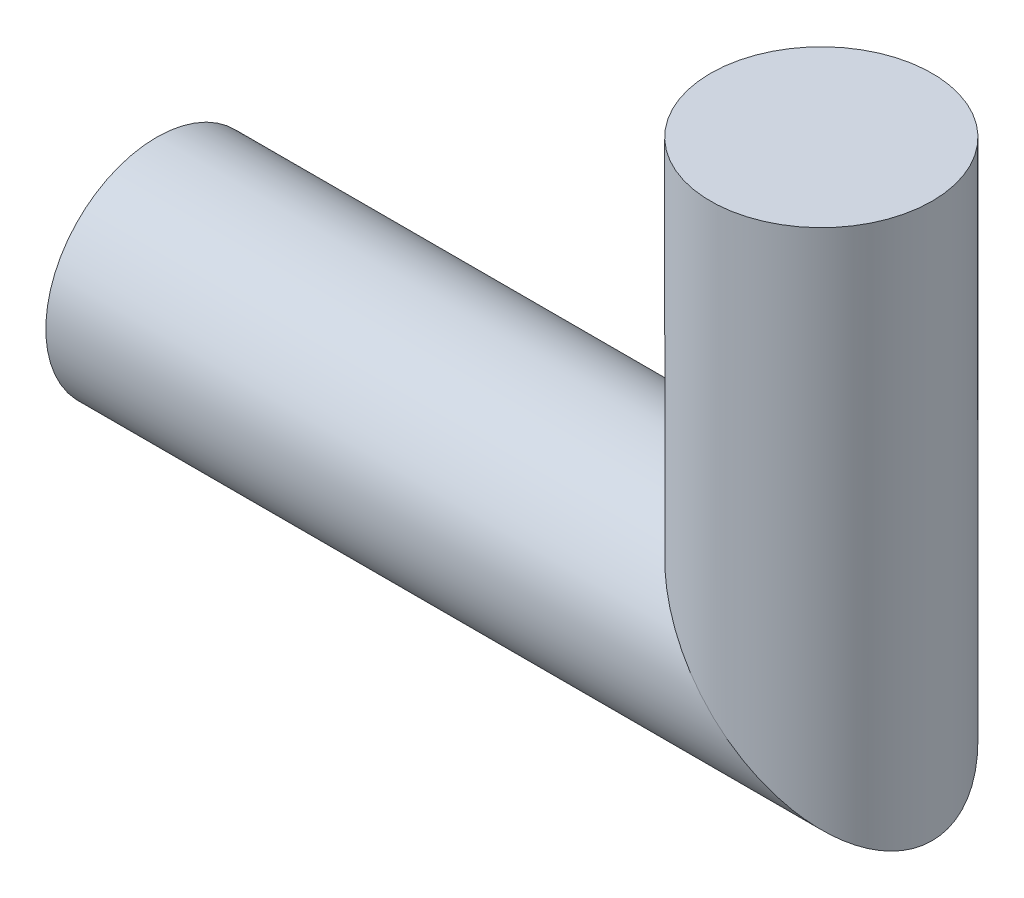
ISO-10303-21;
HEADER;
FILE_DESCRIPTION(('STEP AP214'),'2;1');
FILE_NAME('part.step','',(''),(''),'','','');
FILE_SCHEMA(('AUTOMOTIVE_DESIGN { 1 0 10303 214 1 1 1 1 }'));
ENDSEC;
DATA;
#1=APPLICATION_CONTEXT('core data for automotive mechanical design processes');
#2=APPLICATION_PROTOCOL_DEFINITION('international standard','automotive_design',2000,#1);
#3=PRODUCT_CONTEXT('',#1,'mechanical');
#4=PRODUCT('Part','Part','',(#3));
#5=PRODUCT_RELATED_PRODUCT_CATEGORY('part','',(#4));
#6=PRODUCT_DEFINITION_FORMATION('','',#4);
#7=PRODUCT_DEFINITION_CONTEXT('part definition',#1,'design');
#8=PRODUCT_DEFINITION('design','',#6,#7);
#9=PRODUCT_DEFINITION_SHAPE('','',#8);
#10=(LENGTH_UNIT() NAMED_UNIT(*) SI_UNIT(.MILLI.,.METRE.));
#11=(NAMED_UNIT(*) PLANE_ANGLE_UNIT() SI_UNIT($,.RADIAN.));
#12=(NAMED_UNIT(*) SI_UNIT($,.STERADIAN.) SOLID_ANGLE_UNIT());
#13=UNCERTAINTY_MEASURE_WITH_UNIT(LENGTH_MEASURE(1.E-05),#10,'distance_accuracy_value','');
#14=(GEOMETRIC_REPRESENTATION_CONTEXT(3) GLOBAL_UNCERTAINTY_ASSIGNED_CONTEXT((#13)) GLOBAL_UNIT_ASSIGNED_CONTEXT((#10,
#11,#12)) REPRESENTATION_CONTEXT('',''));
#15=CARTESIAN_POINT('',(0.,0.,0.));
#16=DIRECTION('',(0.,0.,1.));
#17=DIRECTION('',(1.,0.,0.));
#18=AXIS2_PLACEMENT_3D('',#15,#16,#17);
#19=CARTESIAN_POINT('',(-152.4,0.,0.));
#20=DIRECTION('',(1.,0.,0.));
#21=DIRECTION('',(0.,1.,0.));
#22=AXIS2_PLACEMENT_3D('',#19,#20,#21);
#23=PLANE('',#22);
#24=CARTESIAN_POINT('',(-152.4,0.,0.));
#25=DIRECTION('',(-1.,0.,0.));
#26=DIRECTION('',(0.,-1.,0.));
#27=AXIS2_PLACEMENT_3D('',#24,#25,#26);
#28=CIRCLE('',#27,12.7);
#29=CARTESIAN_POINT('',(-152.4,-12.7,0.));
#30=VERTEX_POINT('',#29);
#31=EDGE_CURVE('E51',#30,#30,#28,.T.);
#32=ORIENTED_EDGE('',*,*,#31,.F.);
#33=EDGE_LOOP('',(#32));
#34=FACE_BOUND('',#33,.T.);
#35=CARTESIAN_POINT('',(-152.4,0.,0.));
#36=DIRECTION('',(1.,0.,0.));
#37=DIRECTION('',(0.,1.,0.));
#38=AXIS2_PLACEMENT_3D('',#35,#36,#37);
#39=CIRCLE('',#38,25.4);
#40=CARTESIAN_POINT('',(-152.4,25.4,0.));
#41=VERTEX_POINT('',#40);
#42=EDGE_CURVE('E41',#41,#41,#39,.T.);
#43=ORIENTED_EDGE('',*,*,#42,.F.);
#44=EDGE_LOOP('',(#43));
#45=FACE_BOUND('',#44,.T.);
#46=ADVANCED_FACE('F38',(#34,#45),#23,.F.);
#47=CARTESIAN_POINT('',(0.,101.6,0.));
#48=DIRECTION('',(0.,1.,0.));
#49=DIRECTION('',(-1.,0.,0.));
#50=AXIS2_PLACEMENT_3D('',#47,#48,#49);
#51=PLANE('',#50);
#52=CARTESIAN_POINT('',(0.,101.6,0.));
#53=DIRECTION('',(0.,1.,0.));
#54=DIRECTION('',(-1.,0.,0.));
#55=AXIS2_PLACEMENT_3D('',#52,#53,#54);
#56=CIRCLE('',#55,25.4);
#57=CARTESIAN_POINT('',(-25.4,101.6,0.));
#58=VERTEX_POINT('',#57);
#59=EDGE_CURVE('E45',#58,#58,#56,.T.);
#60=ORIENTED_EDGE('',*,*,#59,.T.);
#61=EDGE_LOOP('',(#60));
#62=FACE_BOUND('',#61,.T.);
#63=ADVANCED_FACE('F64',(#62),#51,.T.);
#64=CARTESIAN_POINT('',(28.04,0.,0.));
#65=DIRECTION('',(-1.,0.,0.));
#66=DIRECTION('',(0.,-1.,0.));
#67=AXIS2_PLACEMENT_3D('',#64,#65,#66);
#68=CYLINDRICAL_SURFACE('',#67,25.4);
#69=CARTESIAN_POINT('',(0.,0.,0.));
#70=DIRECTION('',(-0.707106781186547,-0.707106781186548,0.));
#71=DIRECTION('',(0.707106781186548,-0.707106781186547,0.));
#72=AXIS2_PLACEMENT_3D('',#69,#70,#71);
#73=ELLIPSE('',#72,35.9210244842766,25.4);
#74=CARTESIAN_POINT('',(25.4,-25.4,0.));
#75=VERTEX_POINT('',#74);
#76=EDGE_CURVE('E11',#75,#75,#73,.T.);
#77=ORIENTED_EDGE('',*,*,#76,.T.);
#78=EDGE_LOOP('',(#77));
#79=FACE_BOUND('',#78,.T.);
#80=ORIENTED_EDGE('',*,*,#42,.T.);
#81=EDGE_LOOP('',(#80));
#82=FACE_BOUND('',#81,.T.);
#83=ADVANCED_FACE('F61',(#79,#82),#68,.T.);
#84=CARTESIAN_POINT('',(0.,101.6,0.));
#85=DIRECTION('',(0.,-1.,0.));
#86=DIRECTION('',(0.,0.,-1.));
#87=AXIS2_PLACEMENT_3D('',#84,#85,#86);
#88=CYLINDRICAL_SURFACE('',#87,25.4);
#89=ORIENTED_EDGE('',*,*,#59,.F.);
#90=EDGE_LOOP('',(#89));
#91=FACE_BOUND('',#90,.T.);
#92=ORIENTED_EDGE('',*,*,#76,.F.);
#93=EDGE_LOOP('',(#92));
#94=FACE_BOUND('',#93,.T.);
#95=ADVANCED_FACE('F74',(#91,#94),#88,.T.);
#96=CARTESIAN_POINT('',(-127.,0.,0.));
#97=DIRECTION('',(-1.,0.,0.));
#98=DIRECTION('',(0.,-1.,0.));
#99=AXIS2_PLACEMENT_3D('',#96,#97,#98);
#100=CYLINDRICAL_SURFACE('',#99,12.7);
#101=CARTESIAN_POINT('',(-127.,0.,0.));
#102=DIRECTION('',(-1.,0.,0.));
#103=DIRECTION('',(0.,-1.,0.));
#104=AXIS2_PLACEMENT_3D('',#101,#102,#103);
#105=CIRCLE('',#104,12.7);
#106=CARTESIAN_POINT('',(-127.,-12.7,0.));
#107=VERTEX_POINT('',#106);
#108=EDGE_CURVE('E54',#107,#107,#105,.T.);
#109=ORIENTED_EDGE('',*,*,#108,.F.);
#110=EDGE_LOOP('',(#109));
#111=FACE_BOUND('',#110,.T.);
#112=ORIENTED_EDGE('',*,*,#31,.T.);
#113=EDGE_LOOP('',(#112));
#114=FACE_BOUND('',#113,.T.);
#115=ADVANCED_FACE('F66',(#111,#114),#100,.F.);
#116=CARTESIAN_POINT('',(-127.,0.,0.));
#117=DIRECTION('',(-1.,0.,0.));
#118=DIRECTION('',(0.,-1.,0.));
#119=AXIS2_PLACEMENT_3D('',#116,#117,#118);
#120=PLANE('',#119);
#121=ORIENTED_EDGE('',*,*,#108,.T.);
#122=EDGE_LOOP('',(#121));
#123=FACE_BOUND('',#122,.T.);
#124=ADVANCED_FACE('F73',(#123),#120,.T.);
#125=CLOSED_SHELL('',(#46,#63,#83,#95,#115,#124));
#126=MANIFOLD_SOLID_BREP('B2',#125);
#127=ADVANCED_BREP_SHAPE_REPRESENTATION('',(#18,#126),#14);
#128=SHAPE_DEFINITION_REPRESENTATION(#9,#127);
ENDSEC;
END-ISO-10303-21;
